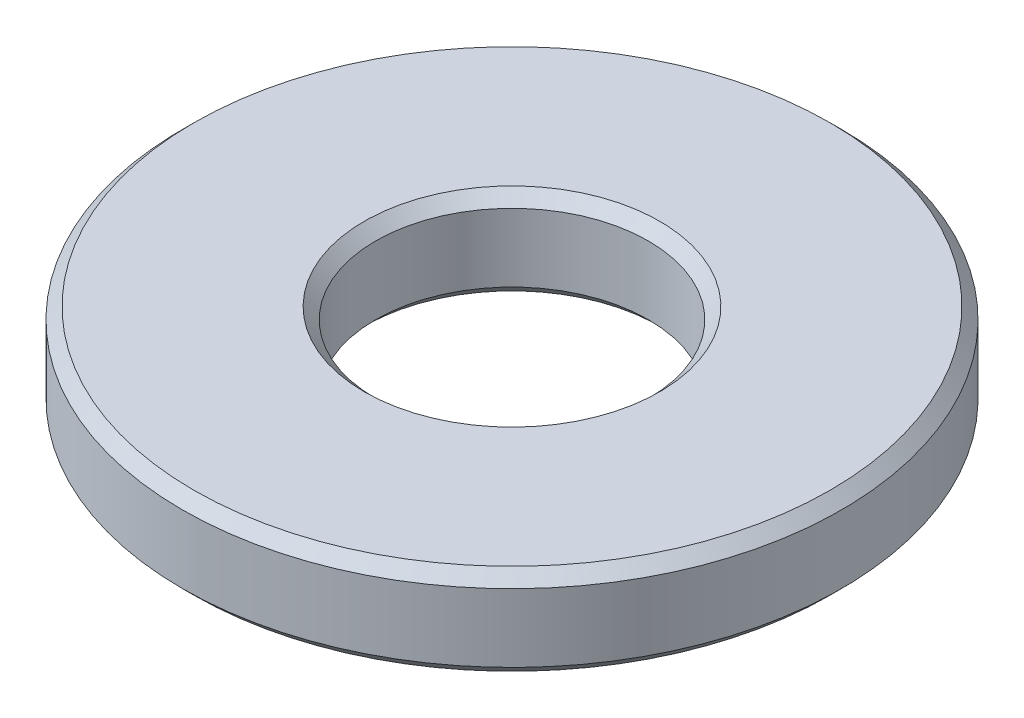
ISO-10303-21;
HEADER;
FILE_DESCRIPTION(('STEP AP214'),'2;1');
FILE_NAME('part.step','',(''),(''),'','','');
FILE_SCHEMA(('AUTOMOTIVE_DESIGN { 1 0 10303 214 1 1 1 1 }'));
ENDSEC;
DATA;
#1=APPLICATION_CONTEXT('core data for automotive mechanical design processes');
#2=APPLICATION_PROTOCOL_DEFINITION('international standard','automotive_design',2000,#1);
#3=PRODUCT_CONTEXT('',#1,'mechanical');
#4=PRODUCT('Part','Part','',(#3));
#5=PRODUCT_RELATED_PRODUCT_CATEGORY('part','',(#4));
#6=PRODUCT_DEFINITION_FORMATION('','',#4);
#7=PRODUCT_DEFINITION_CONTEXT('part definition',#1,'design');
#8=PRODUCT_DEFINITION('design','',#6,#7);
#9=PRODUCT_DEFINITION_SHAPE('','',#8);
#10=(LENGTH_UNIT() NAMED_UNIT(*) SI_UNIT(.MILLI.,.METRE.));
#11=(NAMED_UNIT(*) PLANE_ANGLE_UNIT() SI_UNIT($,.RADIAN.));
#12=(NAMED_UNIT(*) SI_UNIT($,.STERADIAN.) SOLID_ANGLE_UNIT());
#13=UNCERTAINTY_MEASURE_WITH_UNIT(LENGTH_MEASURE(1.E-05),#10,'distance_accuracy_value','');
#14=(GEOMETRIC_REPRESENTATION_CONTEXT(3) GLOBAL_UNCERTAINTY_ASSIGNED_CONTEXT((#13)) GLOBAL_UNIT_ASSIGNED_CONTEXT((#10,
#11,#12)) REPRESENTATION_CONTEXT('',''));
#15=CARTESIAN_POINT('',(0.,0.,0.));
#16=DIRECTION('',(0.,0.,1.));
#17=DIRECTION('',(1.,0.,0.));
#18=AXIS2_PLACEMENT_3D('',#15,#16,#17);
#19=CARTESIAN_POINT('',(0.,8.00000000000001,0.));
#20=DIRECTION('',(0.,-1.,0.));
#21=DIRECTION('',(0.,0.,-1.));
#22=AXIS2_PLACEMENT_3D('',#19,#20,#21);
#23=CYLINDRICAL_SURFACE('',#22,29.);
#24=CARTESIAN_POINT('',(0.,1.,0.));
#25=DIRECTION('',(0.,1.,0.));
#26=DIRECTION('',(0.,0.,1.));
#27=AXIS2_PLACEMENT_3D('',#24,#25,#26);
#28=CIRCLE('',#27,29.);
#29=CARTESIAN_POINT('',(0.,1.,29.));
#30=VERTEX_POINT('',#29);
#31=EDGE_CURVE('E55',#30,#30,#28,.T.);
#32=ORIENTED_EDGE('',*,*,#31,.T.);
#33=EDGE_LOOP('',(#32));
#34=FACE_BOUND('',#33,.T.);
#35=CARTESIAN_POINT('',(0.,7.00000000000001,0.));
#36=DIRECTION('',(0.,1.,0.));
#37=DIRECTION('',(0.,0.,1.));
#38=AXIS2_PLACEMENT_3D('',#35,#36,#37);
#39=CIRCLE('',#38,29.);
#40=CARTESIAN_POINT('',(0.,7.00000000000001,29.));
#41=VERTEX_POINT('',#40);
#42=EDGE_CURVE('E58',#41,#41,#39,.F.);
#43=ORIENTED_EDGE('',*,*,#42,.T.);
#44=EDGE_LOOP('',(#43));
#45=FACE_BOUND('',#44,.T.);
#46=ADVANCED_FACE('F30',(#34,#45),#23,.T.);
#47=CARTESIAN_POINT('',(0.,8.00000000000001,0.));
#48=DIRECTION('',(0.,1.,0.));
#49=DIRECTION('',(0.,0.,1.));
#50=AXIS2_PLACEMENT_3D('',#47,#48,#49);
#51=PLANE('',#50);
#52=CARTESIAN_POINT('',(0.,8.00000000000001,0.));
#53=DIRECTION('',(0.,1.,0.));
#54=DIRECTION('',(0.,0.,1.));
#55=AXIS2_PLACEMENT_3D('',#52,#53,#54);
#56=CIRCLE('',#55,13.);
#57=CARTESIAN_POINT('',(0.,8.00000000000001,13.));
#58=VERTEX_POINT('',#57);
#59=EDGE_CURVE('E10',#58,#58,#56,.F.);
#60=ORIENTED_EDGE('',*,*,#59,.T.);
#61=EDGE_LOOP('',(#60));
#62=FACE_BOUND('',#61,.T.);
#63=CARTESIAN_POINT('',(0.,8.00000000000001,0.));
#64=DIRECTION('',(0.,1.,0.));
#65=DIRECTION('',(0.,0.,1.));
#66=AXIS2_PLACEMENT_3D('',#63,#64,#65);
#67=CIRCLE('',#66,28.);
#68=CARTESIAN_POINT('',(0.,8.00000000000001,28.));
#69=VERTEX_POINT('',#68);
#70=EDGE_CURVE('E49',#69,#69,#67,.T.);
#71=ORIENTED_EDGE('',*,*,#70,.T.);
#72=EDGE_LOOP('',(#71));
#73=FACE_BOUND('',#72,.T.);
#74=ADVANCED_FACE('F71',(#62,#73),#51,.T.);
#75=CARTESIAN_POINT('',(0.,0.,0.));
#76=DIRECTION('',(0.,1.,0.));
#77=DIRECTION('',(0.,0.,1.));
#78=AXIS2_PLACEMENT_3D('',#75,#76,#77);
#79=PLANE('',#78);
#80=CARTESIAN_POINT('',(0.,0.,0.));
#81=DIRECTION('',(0.,1.,0.));
#82=DIRECTION('',(0.,0.,1.));
#83=AXIS2_PLACEMENT_3D('',#80,#81,#82);
#84=CIRCLE('',#83,13.);
#85=CARTESIAN_POINT('',(0.,0.,13.));
#86=VERTEX_POINT('',#85);
#87=EDGE_CURVE('E44',#86,#86,#84,.T.);
#88=ORIENTED_EDGE('',*,*,#87,.T.);
#89=EDGE_LOOP('',(#88));
#90=FACE_BOUND('',#89,.T.);
#91=CARTESIAN_POINT('',(0.,0.,0.));
#92=DIRECTION('',(0.,1.,0.));
#93=DIRECTION('',(0.,0.,1.));
#94=AXIS2_PLACEMENT_3D('',#91,#92,#93);
#95=CIRCLE('',#94,28.);
#96=CARTESIAN_POINT('',(0.,0.,28.));
#97=VERTEX_POINT('',#96);
#98=EDGE_CURVE('E52',#97,#97,#95,.F.);
#99=ORIENTED_EDGE('',*,*,#98,.T.);
#100=EDGE_LOOP('',(#99));
#101=FACE_BOUND('',#100,.T.);
#102=ADVANCED_FACE('F73',(#90,#101),#79,.F.);
#103=CARTESIAN_POINT('',(0.,0.,0.));
#104=DIRECTION('',(0.,1.,0.));
#105=DIRECTION('',(0.,0.,1.));
#106=AXIS2_PLACEMENT_3D('',#103,#104,#105);
#107=CYLINDRICAL_SURFACE('',#106,12.);
#108=CARTESIAN_POINT('',(0.,1.,0.));
#109=DIRECTION('',(0.,1.,0.));
#110=DIRECTION('',(0.,0.,1.));
#111=AXIS2_PLACEMENT_3D('',#108,#109,#110);
#112=CIRCLE('',#111,12.);
#113=CARTESIAN_POINT('',(0.,1.,12.));
#114=VERTEX_POINT('',#113);
#115=EDGE_CURVE('E36',#114,#114,#112,.F.);
#116=ORIENTED_EDGE('',*,*,#115,.T.);
#117=EDGE_LOOP('',(#116));
#118=FACE_BOUND('',#117,.T.);
#119=CARTESIAN_POINT('',(0.,7.00000000000001,0.));
#120=DIRECTION('',(0.,1.,0.));
#121=DIRECTION('',(0.,0.,1.));
#122=AXIS2_PLACEMENT_3D('',#119,#120,#121);
#123=CIRCLE('',#122,12.);
#124=CARTESIAN_POINT('',(0.,7.00000000000001,12.));
#125=VERTEX_POINT('',#124);
#126=EDGE_CURVE('E40',#125,#125,#123,.T.);
#127=ORIENTED_EDGE('',*,*,#126,.T.);
#128=EDGE_LOOP('',(#127));
#129=FACE_BOUND('',#128,.T.);
#130=ADVANCED_FACE('F78',(#118,#129),#107,.F.);
#131=CARTESIAN_POINT('',(0.,1.,0.));
#132=DIRECTION('',(0.,1.,0.));
#133=DIRECTION('',(0.,0.,1.));
#134=AXIS2_PLACEMENT_3D('',#131,#132,#133);
#135=CONICAL_SURFACE('',#134,29.,0.78539816339745);
#136=ORIENTED_EDGE('',*,*,#98,.F.);
#137=EDGE_LOOP('',(#136));
#138=FACE_BOUND('',#137,.T.);
#139=ORIENTED_EDGE('',*,*,#31,.F.);
#140=EDGE_LOOP('',(#139));
#141=FACE_BOUND('',#140,.T.);
#142=ADVANCED_FACE('F67',(#138,#141),#135,.T.);
#143=CARTESIAN_POINT('',(0.,8.00000000000001,0.));
#144=DIRECTION('',(0.,-1.,0.));
#145=DIRECTION('',(0.,0.,-1.));
#146=AXIS2_PLACEMENT_3D('',#143,#144,#145);
#147=CONICAL_SURFACE('',#146,28.,0.785398163397447);
#148=ORIENTED_EDGE('',*,*,#42,.F.);
#149=EDGE_LOOP('',(#148));
#150=FACE_BOUND('',#149,.T.);
#151=ORIENTED_EDGE('',*,*,#70,.F.);
#152=EDGE_LOOP('',(#151));
#153=FACE_BOUND('',#152,.T.);
#154=ADVANCED_FACE('F63',(#150,#153),#147,.T.);
#155=CARTESIAN_POINT('',(0.,0.,0.));
#156=DIRECTION('',(0.,-1.,0.));
#157=DIRECTION('',(0.,0.,-1.));
#158=AXIS2_PLACEMENT_3D('',#155,#156,#157);
#159=CONICAL_SURFACE('',#158,13.,0.785398163397447);
#160=ORIENTED_EDGE('',*,*,#115,.F.);
#161=EDGE_LOOP('',(#160));
#162=FACE_BOUND('',#161,.T.);
#163=ORIENTED_EDGE('',*,*,#87,.F.);
#164=EDGE_LOOP('',(#163));
#165=FACE_BOUND('',#164,.T.);
#166=ADVANCED_FACE('F66',(#162,#165),#159,.F.);
#167=CARTESIAN_POINT('',(0.,7.00000000000001,0.));
#168=DIRECTION('',(0.,1.,0.));
#169=DIRECTION('',(0.,0.,1.));
#170=AXIS2_PLACEMENT_3D('',#167,#168,#169);
#171=CONICAL_SURFACE('',#170,12.,0.785398163397449);
#172=ORIENTED_EDGE('',*,*,#59,.F.);
#173=EDGE_LOOP('',(#172));
#174=FACE_BOUND('',#173,.T.);
#175=ORIENTED_EDGE('',*,*,#126,.F.);
#176=EDGE_LOOP('',(#175));
#177=FACE_BOUND('',#176,.T.);
#178=ADVANCED_FACE('F90',(#174,#177),#171,.F.);
#179=CLOSED_SHELL('',(#46,#74,#102,#130,#142,#154,#166,#178));
#180=MANIFOLD_SOLID_BREP('B2',#179);
#181=ADVANCED_BREP_SHAPE_REPRESENTATION('',(#18,#180),#14);
#182=SHAPE_DEFINITION_REPRESENTATION(#9,#181);
ENDSEC;
END-ISO-10303-21;
